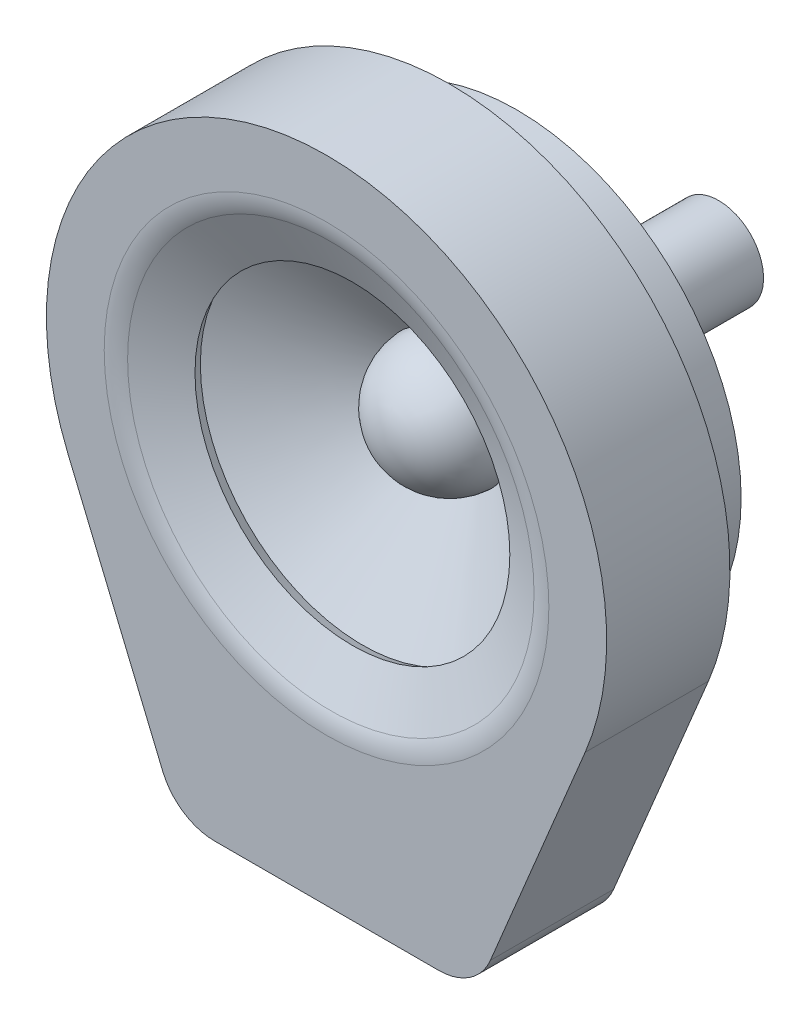
ISO-10303-21;
HEADER;
FILE_DESCRIPTION(('STEP AP214'),'2;1');
FILE_NAME('part.step','',(''),(''),'','','');
FILE_SCHEMA(('AUTOMOTIVE_DESIGN { 1 0 10303 214 1 1 1 1 }'));
ENDSEC;
DATA;
#1=APPLICATION_CONTEXT('core data for automotive mechanical design processes');
#2=APPLICATION_PROTOCOL_DEFINITION('international standard','automotive_design',2000,#1);
#3=PRODUCT_CONTEXT('',#1,'mechanical');
#4=PRODUCT('Part','Part','',(#3));
#5=PRODUCT_RELATED_PRODUCT_CATEGORY('part','',(#4));
#6=PRODUCT_DEFINITION_FORMATION('','',#4);
#7=PRODUCT_DEFINITION_CONTEXT('part definition',#1,'design');
#8=PRODUCT_DEFINITION('design','',#6,#7);
#9=PRODUCT_DEFINITION_SHAPE('','',#8);
#10=(LENGTH_UNIT() NAMED_UNIT(*) SI_UNIT(.MILLI.,.METRE.));
#11=(NAMED_UNIT(*) PLANE_ANGLE_UNIT() SI_UNIT($,.RADIAN.));
#12=(NAMED_UNIT(*) SI_UNIT($,.STERADIAN.) SOLID_ANGLE_UNIT());
#13=UNCERTAINTY_MEASURE_WITH_UNIT(LENGTH_MEASURE(1.E-05),#10,'distance_accuracy_value','');
#14=(GEOMETRIC_REPRESENTATION_CONTEXT(3) GLOBAL_UNCERTAINTY_ASSIGNED_CONTEXT((#13)) GLOBAL_UNIT_ASSIGNED_CONTEXT((#10,
#11,#12)) REPRESENTATION_CONTEXT('',''));
#15=CARTESIAN_POINT('',(0.,0.,0.));
#16=DIRECTION('',(0.,0.,1.));
#17=DIRECTION('',(1.,0.,0.));
#18=AXIS2_PLACEMENT_3D('',#15,#16,#17);
#19=CARTESIAN_POINT('',(0.,0.,0.));
#20=DIRECTION('',(0.,0.,1.));
#21=DIRECTION('',(1.,0.,0.));
#22=AXIS2_PLACEMENT_3D('',#19,#20,#21);
#23=PLANE('',#22);
#24=CARTESIAN_POINT('',(0.,0.,0.));
#25=DIRECTION('',(0.,0.,1.));
#26=DIRECTION('',(1.,0.,0.));
#27=AXIS2_PLACEMENT_3D('',#24,#25,#26);
#28=CIRCLE('',#27,12.5);
#29=CARTESIAN_POINT('',(11.5392129441462,-4.80588853695639,0.));
#30=VERTEX_POINT('',#29);
#31=CARTESIAN_POINT('',(-11.5392129441462,-4.80588853695639,0.));
#32=VERTEX_POINT('',#31);
#33=EDGE_CURVE('E144',#30,#32,#28,.T.);
#34=ORIENTED_EDGE('',*,*,#33,.F.);
#35=DIRECTION('',(0.384471082956511,0.923137035531696,0.));
#36=VECTOR('',#35,1.);
#37=CARTESIAN_POINT('',(7.30970543354696,-14.9611777073913,0.));
#38=LINE('',#37,#36);
#39=CARTESIAN_POINT('',(7.30970543354696,-14.9611777073913,0.));
#40=VERTEX_POINT('',#39);
#41=EDGE_CURVE('E68',#40,#30,#38,.T.);
#42=ORIENTED_EDGE('',*,*,#41,.F.);
#43=CARTESIAN_POINT('',(5.00186284471772,-14.,0.));
#44=DIRECTION('',(0.,0.,1.));
#45=DIRECTION('',(1.,0.,0.));
#46=AXIS2_PLACEMENT_3D('',#43,#44,#45);
#47=CIRCLE('',#46,2.5);
#48=CARTESIAN_POINT('',(5.00186284471772,-16.5,0.));
#49=VERTEX_POINT('',#48);
#50=EDGE_CURVE('E229',#49,#40,#47,.T.);
#51=ORIENTED_EDGE('',*,*,#50,.F.);
#52=DIRECTION('',(1.,0.,0.));
#53=VECTOR('',#52,1.);
#54=CARTESIAN_POINT('',(-5.00186284471772,-16.5,0.));
#55=LINE('',#54,#53);
#56=CARTESIAN_POINT('',(-5.00186284471771,-16.5,0.));
#57=VERTEX_POINT('',#56);
#58=EDGE_CURVE('E227',#57,#49,#55,.T.);
#59=ORIENTED_EDGE('',*,*,#58,.F.);
#60=CARTESIAN_POINT('',(-5.00186284471772,-14.,0.));
#61=DIRECTION('',(0.,0.,1.));
#62=DIRECTION('',(1.,0.,0.));
#63=AXIS2_PLACEMENT_3D('',#60,#61,#62);
#64=CIRCLE('',#63,2.5);
#65=CARTESIAN_POINT('',(-7.30970543354696,-14.9611777073913,0.));
#66=VERTEX_POINT('',#65);
#67=EDGE_CURVE('E225',#66,#57,#64,.T.);
#68=ORIENTED_EDGE('',*,*,#67,.F.);
#69=DIRECTION('',(0.384471082956511,-0.923137035531696,0.));
#70=VECTOR('',#69,1.);
#71=CARTESIAN_POINT('',(-7.30970543354696,-14.9611777073913,0.));
#72=LINE('',#71,#70);
#73=EDGE_CURVE('E223',#32,#66,#72,.T.);
#74=ORIENTED_EDGE('',*,*,#73,.F.);
#75=EDGE_LOOP('',(#34,#42,#51,#59,#68,#74));
#76=FACE_BOUND('',#75,.T.);
#77=CARTESIAN_POINT('',(0.,0.,0.));
#78=DIRECTION('',(0.,0.,1.));
#79=DIRECTION('',(1.,0.,0.));
#80=AXIS2_PLACEMENT_3D('',#77,#78,#79);
#81=CIRCLE('',#80,12.);
#82=CARTESIAN_POINT('',(11.0776444263804,-4.61365299547813,0.));
#83=VERTEX_POINT('',#82);
#84=CARTESIAN_POINT('',(-11.0776444263804,-4.61365299547814,0.));
#85=VERTEX_POINT('',#84);
#86=EDGE_CURVE('E60',#83,#85,#81,.T.);
#87=ORIENTED_EDGE('',*,*,#86,.T.);
#88=DIRECTION('',(0.384471082956511,-0.923137035531696,0.));
#89=VECTOR('',#88,1.);
#90=CARTESIAN_POINT('',(-6.84813691578111,-14.768942165913,0.));
#91=LINE('',#90,#89);
#92=CARTESIAN_POINT('',(-6.84813691578111,-14.768942165913,0.));
#93=VERTEX_POINT('',#92);
#94=EDGE_CURVE('E197',#85,#93,#91,.T.);
#95=ORIENTED_EDGE('',*,*,#94,.T.);
#96=CARTESIAN_POINT('',(-5.00186284471772,-14.,0.));
#97=DIRECTION('',(0.,0.,1.));
#98=DIRECTION('',(1.,0.,0.));
#99=AXIS2_PLACEMENT_3D('',#96,#97,#98);
#100=CIRCLE('',#99,2.);
#101=CARTESIAN_POINT('',(-5.00186284471772,-16.,0.));
#102=VERTEX_POINT('',#101);
#103=EDGE_CURVE('E200',#93,#102,#100,.T.);
#104=ORIENTED_EDGE('',*,*,#103,.T.);
#105=DIRECTION('',(1.,0.,0.));
#106=VECTOR('',#105,1.);
#107=CARTESIAN_POINT('',(-5.00186284471772,-16.,0.));
#108=LINE('',#107,#106);
#109=CARTESIAN_POINT('',(5.00186284471772,-16.,0.));
#110=VERTEX_POINT('',#109);
#111=EDGE_CURVE('E203',#102,#110,#108,.T.);
#112=ORIENTED_EDGE('',*,*,#111,.T.);
#113=CARTESIAN_POINT('',(5.00186284471772,-14.,0.));
#114=DIRECTION('',(0.,0.,1.));
#115=DIRECTION('',(1.,0.,0.));
#116=AXIS2_PLACEMENT_3D('',#113,#114,#115);
#117=CIRCLE('',#116,2.);
#118=CARTESIAN_POINT('',(6.84813691578111,-14.768942165913,0.));
#119=VERTEX_POINT('',#118);
#120=EDGE_CURVE('E206',#110,#119,#117,.T.);
#121=ORIENTED_EDGE('',*,*,#120,.T.);
#122=DIRECTION('',(0.384471082956511,0.923137035531696,0.));
#123=VECTOR('',#122,1.);
#124=CARTESIAN_POINT('',(6.84813691578111,-14.768942165913,0.));
#125=LINE('',#124,#123);
#126=EDGE_CURVE('E180',#119,#83,#125,.T.);
#127=ORIENTED_EDGE('',*,*,#126,.T.);
#128=EDGE_LOOP('',(#87,#95,#104,#112,#121,#127));
#129=FACE_BOUND('',#128,.T.);
#130=ADVANCED_FACE('F45',(#76,#129),#23,.F.);
#131=CARTESIAN_POINT('',(0.,0.,5.));
#132=DIRECTION('',(0.,0.,-1.));
#133=DIRECTION('',(-1.,0.,0.));
#134=AXIS2_PLACEMENT_3D('',#131,#132,#133);
#135=CYLINDRICAL_SURFACE('',#134,12.5);
#136=ORIENTED_EDGE('',*,*,#33,.T.);
#137=DIRECTION('',(0.,0.,-1.));
#138=VECTOR('',#137,1.);
#139=CARTESIAN_POINT('',(-11.5392129441462,-4.80588853695639,5.));
#140=LINE('',#139,#138);
#141=CARTESIAN_POINT('',(-11.5392129441462,-4.80588853695639,5.5));
#142=VERTEX_POINT('',#141);
#143=EDGE_CURVE('E138',#142,#32,#140,.T.);
#144=ORIENTED_EDGE('',*,*,#143,.F.);
#145=CARTESIAN_POINT('',(0.,0.,5.5));
#146=DIRECTION('',(0.,0.,1.));
#147=DIRECTION('',(1.,0.,0.));
#148=AXIS2_PLACEMENT_3D('',#145,#146,#147);
#149=CIRCLE('',#148,12.5);
#150=CARTESIAN_POINT('',(11.5392129441462,-4.80588853695639,5.5));
#151=VERTEX_POINT('',#150);
#152=EDGE_CURVE('E142',#151,#142,#149,.T.);
#153=ORIENTED_EDGE('',*,*,#152,.F.);
#154=DIRECTION('',(0.,0.,-1.));
#155=VECTOR('',#154,1.);
#156=CARTESIAN_POINT('',(11.5392129441462,-4.80588853695639,5.));
#157=LINE('',#156,#155);
#158=EDGE_CURVE('E232',#151,#30,#157,.T.);
#159=ORIENTED_EDGE('',*,*,#158,.T.);
#160=EDGE_LOOP('',(#136,#144,#153,#159));
#161=FACE_BOUND('',#160,.T.);
#162=ADVANCED_FACE('F140',(#161),#135,.T.);
#163=CARTESIAN_POINT('',(-7.30970543354696,-14.9611777073913,5.));
#164=DIRECTION('',(0.923137035531696,0.384471082956511,0.));
#165=DIRECTION('',(-0.384471082956511,0.923137035531696,0.));
#166=AXIS2_PLACEMENT_3D('',#163,#164,#165);
#167=PLANE('',#166);
#168=ORIENTED_EDGE('',*,*,#73,.T.);
#169=DIRECTION('',(0.,0.,-1.));
#170=VECTOR('',#169,1.);
#171=CARTESIAN_POINT('',(-7.30970543354696,-14.9611777073913,5.));
#172=LINE('',#171,#170);
#173=CARTESIAN_POINT('',(-7.30970543354696,-14.9611777073913,5.5));
#174=VERTEX_POINT('',#173);
#175=EDGE_CURVE('E146',#174,#66,#172,.T.);
#176=ORIENTED_EDGE('',*,*,#175,.F.);
#177=DIRECTION('',(0.384471082956511,-0.923137035531696,0.));
#178=VECTOR('',#177,1.);
#179=CARTESIAN_POINT('',(-11.5392129441462,-4.80588853695639,5.5));
#180=LINE('',#179,#178);
#181=EDGE_CURVE('E149',#142,#174,#180,.T.);
#182=ORIENTED_EDGE('',*,*,#181,.F.);
#183=ORIENTED_EDGE('',*,*,#143,.T.);
#184=EDGE_LOOP('',(#168,#176,#182,#183));
#185=FACE_BOUND('',#184,.T.);
#186=ADVANCED_FACE('F150',(#185),#167,.F.);
#187=CARTESIAN_POINT('',(-5.00186284471772,-14.,5.));
#188=DIRECTION('',(0.,0.,-1.));
#189=DIRECTION('',(-1.,0.,0.));
#190=AXIS2_PLACEMENT_3D('',#187,#188,#189);
#191=CYLINDRICAL_SURFACE('',#190,2.5);
#192=ORIENTED_EDGE('',*,*,#67,.T.);
#193=DIRECTION('',(0.,0.,-1.));
#194=VECTOR('',#193,1.);
#195=CARTESIAN_POINT('',(-5.00186284471771,-16.5,5.));
#196=LINE('',#195,#194);
#197=CARTESIAN_POINT('',(-5.00186284471772,-16.5,5.5));
#198=VERTEX_POINT('',#197);
#199=EDGE_CURVE('E239',#198,#57,#196,.T.);
#200=ORIENTED_EDGE('',*,*,#199,.F.);
#201=CARTESIAN_POINT('',(-5.00186284471772,-14.,5.5));
#202=DIRECTION('',(0.,0.,1.));
#203=DIRECTION('',(1.,0.,0.));
#204=AXIS2_PLACEMENT_3D('',#201,#202,#203);
#205=CIRCLE('',#204,2.5);
#206=EDGE_CURVE('E155',#174,#198,#205,.T.);
#207=ORIENTED_EDGE('',*,*,#206,.F.);
#208=ORIENTED_EDGE('',*,*,#175,.T.);
#209=EDGE_LOOP('',(#192,#200,#207,#208));
#210=FACE_BOUND('',#209,.T.);
#211=ADVANCED_FACE('F277',(#210),#191,.T.);
#212=CARTESIAN_POINT('',(-5.00186284471772,-16.5,5.));
#213=DIRECTION('',(0.,1.,0.));
#214=DIRECTION('',(0.,0.,1.));
#215=AXIS2_PLACEMENT_3D('',#212,#213,#214);
#216=PLANE('',#215);
#217=ORIENTED_EDGE('',*,*,#58,.T.);
#218=DIRECTION('',(0.,0.,-1.));
#219=VECTOR('',#218,1.);
#220=CARTESIAN_POINT('',(5.00186284471772,-16.5,5.));
#221=LINE('',#220,#219);
#222=CARTESIAN_POINT('',(5.00186284471772,-16.5,5.5));
#223=VERTEX_POINT('',#222);
#224=EDGE_CURVE('E236',#223,#49,#221,.T.);
#225=ORIENTED_EDGE('',*,*,#224,.F.);
#226=DIRECTION('',(1.,0.,0.));
#227=VECTOR('',#226,1.);
#228=CARTESIAN_POINT('',(-5.00186284471772,-16.5,5.5));
#229=LINE('',#228,#227);
#230=EDGE_CURVE('E170',#198,#223,#229,.T.);
#231=ORIENTED_EDGE('',*,*,#230,.F.);
#232=ORIENTED_EDGE('',*,*,#199,.T.);
#233=EDGE_LOOP('',(#217,#225,#231,#232));
#234=FACE_BOUND('',#233,.T.);
#235=ADVANCED_FACE('F273',(#234),#216,.F.);
#236=CARTESIAN_POINT('',(5.00186284471772,-14.,5.));
#237=DIRECTION('',(0.,0.,-1.));
#238=DIRECTION('',(-1.,0.,0.));
#239=AXIS2_PLACEMENT_3D('',#236,#237,#238);
#240=CYLINDRICAL_SURFACE('',#239,2.5);
#241=ORIENTED_EDGE('',*,*,#50,.T.);
#242=DIRECTION('',(0.,0.,-1.));
#243=VECTOR('',#242,1.);
#244=CARTESIAN_POINT('',(7.30970543354696,-14.9611777073913,5.));
#245=LINE('',#244,#243);
#246=CARTESIAN_POINT('',(7.30970543354696,-14.9611777073913,5.5));
#247=VERTEX_POINT('',#246);
#248=EDGE_CURVE('E234',#247,#40,#245,.T.);
#249=ORIENTED_EDGE('',*,*,#248,.F.);
#250=CARTESIAN_POINT('',(5.00186284471772,-14.,5.5));
#251=DIRECTION('',(0.,0.,1.));
#252=DIRECTION('',(1.,0.,0.));
#253=AXIS2_PLACEMENT_3D('',#250,#251,#252);
#254=CIRCLE('',#253,2.5);
#255=EDGE_CURVE('E173',#223,#247,#254,.T.);
#256=ORIENTED_EDGE('',*,*,#255,.F.);
#257=ORIENTED_EDGE('',*,*,#224,.T.);
#258=EDGE_LOOP('',(#241,#249,#256,#257));
#259=FACE_BOUND('',#258,.T.);
#260=ADVANCED_FACE('F270',(#259),#240,.T.);
#261=CARTESIAN_POINT('',(7.30970543354696,-14.9611777073913,5.));
#262=DIRECTION('',(-0.923137035531696,0.384471082956511,0.));
#263=DIRECTION('',(-0.384471082956511,-0.923137035531696,0.));
#264=AXIS2_PLACEMENT_3D('',#261,#262,#263);
#265=PLANE('',#264);
#266=ORIENTED_EDGE('',*,*,#41,.T.);
#267=ORIENTED_EDGE('',*,*,#158,.F.);
#268=DIRECTION('',(0.384471082956511,0.923137035531696,0.));
#269=VECTOR('',#268,1.);
#270=CARTESIAN_POINT('',(7.30970543354696,-14.9611777073913,5.5));
#271=LINE('',#270,#269);
#272=EDGE_CURVE('E161',#247,#151,#271,.T.);
#273=ORIENTED_EDGE('',*,*,#272,.F.);
#274=ORIENTED_EDGE('',*,*,#248,.T.);
#275=EDGE_LOOP('',(#266,#267,#273,#274));
#276=FACE_BOUND('',#275,.T.);
#277=ADVANCED_FACE('F267',(#276),#265,.F.);
#278=CARTESIAN_POINT('',(0.,0.,5.));
#279=DIRECTION('',(0.,0.,-1.));
#280=DIRECTION('',(-1.,0.,0.));
#281=AXIS2_PLACEMENT_3D('',#278,#279,#280);
#282=CYLINDRICAL_SURFACE('',#281,12.);
#283=ORIENTED_EDGE('',*,*,#86,.F.);
#284=DIRECTION('',(0.,0.,-1.));
#285=VECTOR('',#284,1.);
#286=CARTESIAN_POINT('',(11.0776444263804,-4.61365299547813,5.));
#287=LINE('',#286,#285);
#288=CARTESIAN_POINT('',(11.0776444263804,-4.61365299547813,5.));
#289=VERTEX_POINT('',#288);
#290=EDGE_CURVE('E195',#289,#83,#287,.T.);
#291=ORIENTED_EDGE('',*,*,#290,.F.);
#292=CARTESIAN_POINT('',(0.,0.,5.));
#293=DIRECTION('',(0.,0.,1.));
#294=DIRECTION('',(1.,0.,0.));
#295=AXIS2_PLACEMENT_3D('',#292,#293,#294);
#296=CIRCLE('',#295,12.);
#297=CARTESIAN_POINT('',(-11.0776444263804,-4.61365299547813,5.));
#298=VERTEX_POINT('',#297);
#299=EDGE_CURVE('E176',#289,#298,#296,.T.);
#300=ORIENTED_EDGE('',*,*,#299,.T.);
#301=DIRECTION('',(0.,0.,-1.));
#302=VECTOR('',#301,1.);
#303=CARTESIAN_POINT('',(-11.0776444263804,-4.61365299547814,5.));
#304=LINE('',#303,#302);
#305=EDGE_CURVE('E220',#298,#85,#304,.T.);
#306=ORIENTED_EDGE('',*,*,#305,.T.);
#307=EDGE_LOOP('',(#283,#291,#300,#306));
#308=FACE_BOUND('',#307,.T.);
#309=ADVANCED_FACE('F265',(#308),#282,.F.);
#310=CARTESIAN_POINT('',(-6.84813691578111,-14.768942165913,5.));
#311=DIRECTION('',(0.923137035531696,0.384471082956511,0.));
#312=DIRECTION('',(-0.384471082956511,0.923137035531696,0.));
#313=AXIS2_PLACEMENT_3D('',#310,#311,#312);
#314=PLANE('',#313);
#315=ORIENTED_EDGE('',*,*,#94,.F.);
#316=ORIENTED_EDGE('',*,*,#305,.F.);
#317=DIRECTION('',(0.384471082956511,-0.923137035531696,0.));
#318=VECTOR('',#317,1.);
#319=CARTESIAN_POINT('',(-6.84813691578111,-14.768942165913,5.));
#320=LINE('',#319,#318);
#321=CARTESIAN_POINT('',(-6.84813691578111,-14.768942165913,5.));
#322=VERTEX_POINT('',#321);
#323=EDGE_CURVE('E179',#298,#322,#320,.T.);
#324=ORIENTED_EDGE('',*,*,#323,.T.);
#325=DIRECTION('',(0.,0.,-1.));
#326=VECTOR('',#325,1.);
#327=CARTESIAN_POINT('',(-6.84813691578111,-14.768942165913,5.));
#328=LINE('',#327,#326);
#329=EDGE_CURVE('E218',#322,#93,#328,.T.);
#330=ORIENTED_EDGE('',*,*,#329,.T.);
#331=EDGE_LOOP('',(#315,#316,#324,#330));
#332=FACE_BOUND('',#331,.T.);
#333=ADVANCED_FACE('F309',(#332),#314,.T.);
#334=CARTESIAN_POINT('',(-5.00186284471772,-14.,5.));
#335=DIRECTION('',(0.,0.,-1.));
#336=DIRECTION('',(-1.,0.,0.));
#337=AXIS2_PLACEMENT_3D('',#334,#335,#336);
#338=CYLINDRICAL_SURFACE('',#337,2.);
#339=ORIENTED_EDGE('',*,*,#103,.F.);
#340=ORIENTED_EDGE('',*,*,#329,.F.);
#341=CARTESIAN_POINT('',(-5.00186284471772,-14.,5.));
#342=DIRECTION('',(0.,0.,1.));
#343=DIRECTION('',(1.,0.,0.));
#344=AXIS2_PLACEMENT_3D('',#341,#342,#343);
#345=CIRCLE('',#344,2.);
#346=CARTESIAN_POINT('',(-5.00186284471772,-16.,5.));
#347=VERTEX_POINT('',#346);
#348=EDGE_CURVE('E183',#322,#347,#345,.T.);
#349=ORIENTED_EDGE('',*,*,#348,.T.);
#350=DIRECTION('',(0.,0.,-1.));
#351=VECTOR('',#350,1.);
#352=CARTESIAN_POINT('',(-5.00186284471772,-16.,5.));
#353=LINE('',#352,#351);
#354=EDGE_CURVE('E216',#347,#102,#353,.T.);
#355=ORIENTED_EDGE('',*,*,#354,.T.);
#356=EDGE_LOOP('',(#339,#340,#349,#355));
#357=FACE_BOUND('',#356,.T.);
#358=ADVANCED_FACE('F315',(#357),#338,.F.);
#359=CARTESIAN_POINT('',(-5.00186284471772,-16.,5.));
#360=DIRECTION('',(0.,1.,0.));
#361=DIRECTION('',(0.,0.,1.));
#362=AXIS2_PLACEMENT_3D('',#359,#360,#361);
#363=PLANE('',#362);
#364=ORIENTED_EDGE('',*,*,#111,.F.);
#365=ORIENTED_EDGE('',*,*,#354,.F.);
#366=DIRECTION('',(1.,0.,0.));
#367=VECTOR('',#366,1.);
#368=CARTESIAN_POINT('',(-5.00186284471772,-16.,5.));
#369=LINE('',#368,#367);
#370=CARTESIAN_POINT('',(5.00186284471772,-16.,5.));
#371=VERTEX_POINT('',#370);
#372=EDGE_CURVE('E186',#347,#371,#369,.T.);
#373=ORIENTED_EDGE('',*,*,#372,.T.);
#374=DIRECTION('',(0.,0.,-1.));
#375=VECTOR('',#374,1.);
#376=CARTESIAN_POINT('',(5.00186284471772,-16.,5.));
#377=LINE('',#376,#375);
#378=EDGE_CURVE('E214',#371,#110,#377,.T.);
#379=ORIENTED_EDGE('',*,*,#378,.T.);
#380=EDGE_LOOP('',(#364,#365,#373,#379));
#381=FACE_BOUND('',#380,.T.);
#382=ADVANCED_FACE('F322',(#381),#363,.T.);
#383=CARTESIAN_POINT('',(5.00186284471772,-14.,5.));
#384=DIRECTION('',(0.,0.,-1.));
#385=DIRECTION('',(-1.,0.,0.));
#386=AXIS2_PLACEMENT_3D('',#383,#384,#385);
#387=CYLINDRICAL_SURFACE('',#386,2.);
#388=ORIENTED_EDGE('',*,*,#120,.F.);
#389=ORIENTED_EDGE('',*,*,#378,.F.);
#390=CARTESIAN_POINT('',(5.00186284471772,-14.,5.));
#391=DIRECTION('',(0.,0.,1.));
#392=DIRECTION('',(1.,0.,0.));
#393=AXIS2_PLACEMENT_3D('',#390,#391,#392);
#394=CIRCLE('',#393,2.);
#395=CARTESIAN_POINT('',(6.84813691578111,-14.768942165913,5.));
#396=VERTEX_POINT('',#395);
#397=EDGE_CURVE('E189',#371,#396,#394,.T.);
#398=ORIENTED_EDGE('',*,*,#397,.T.);
#399=DIRECTION('',(0.,0.,-1.));
#400=VECTOR('',#399,1.);
#401=CARTESIAN_POINT('',(6.84813691578111,-14.768942165913,5.));
#402=LINE('',#401,#400);
#403=EDGE_CURVE('E212',#396,#119,#402,.T.);
#404=ORIENTED_EDGE('',*,*,#403,.T.);
#405=EDGE_LOOP('',(#388,#389,#398,#404));
#406=FACE_BOUND('',#405,.T.);
#407=ADVANCED_FACE('F330',(#406),#387,.F.);
#408=CARTESIAN_POINT('',(6.84813691578111,-14.768942165913,5.));
#409=DIRECTION('',(-0.923137035531696,0.384471082956511,0.));
#410=DIRECTION('',(-0.384471082956511,-0.923137035531696,0.));
#411=AXIS2_PLACEMENT_3D('',#408,#409,#410);
#412=PLANE('',#411);
#413=ORIENTED_EDGE('',*,*,#126,.F.);
#414=ORIENTED_EDGE('',*,*,#403,.F.);
#415=DIRECTION('',(0.384471082956511,0.923137035531696,0.));
#416=VECTOR('',#415,1.);
#417=CARTESIAN_POINT('',(6.84813691578111,-14.768942165913,5.));
#418=LINE('',#417,#416);
#419=EDGE_CURVE('E192',#396,#289,#418,.T.);
#420=ORIENTED_EDGE('',*,*,#419,.T.);
#421=ORIENTED_EDGE('',*,*,#290,.T.);
#422=EDGE_LOOP('',(#413,#414,#420,#421));
#423=FACE_BOUND('',#422,.T.);
#424=ADVANCED_FACE('F338',(#423),#412,.T.);
#425=CARTESIAN_POINT('',(0.,0.,5.5));
#426=DIRECTION('',(0.,0.,1.));
#427=DIRECTION('',(1.,0.,0.));
#428=AXIS2_PLACEMENT_3D('',#425,#426,#427);
#429=PLANE('',#428);
#430=CARTESIAN_POINT('',(0.,0.,5.5));
#431=DIRECTION('',(0.,0.,1.));
#432=DIRECTION('',(1.,0.,0.));
#433=AXIS2_PLACEMENT_3D('',#430,#431,#432);
#434=CIRCLE('',#433,9.92109103035221);
#435=CARTESIAN_POINT('',(9.92109103035221,0.,5.5));
#436=VERTEX_POINT('',#435);
#437=EDGE_CURVE('E53',#436,#436,#434,.F.);
#438=ORIENTED_EDGE('',*,*,#437,.T.);
#439=EDGE_LOOP('',(#438));
#440=FACE_BOUND('',#439,.T.);
#441=ORIENTED_EDGE('',*,*,#152,.T.);
#442=ORIENTED_EDGE('',*,*,#181,.T.);
#443=ORIENTED_EDGE('',*,*,#206,.T.);
#444=ORIENTED_EDGE('',*,*,#230,.T.);
#445=ORIENTED_EDGE('',*,*,#255,.T.);
#446=ORIENTED_EDGE('',*,*,#272,.T.);
#447=EDGE_LOOP('',(#441,#442,#443,#444,#445,#446));
#448=FACE_BOUND('',#447,.T.);
#449=ADVANCED_FACE('F158',(#440,#448),#429,.T.);
#450=CARTESIAN_POINT('',(0.,0.,5.));
#451=DIRECTION('',(0.,0.,1.));
#452=DIRECTION('',(1.,0.,0.));
#453=AXIS2_PLACEMENT_3D('',#450,#451,#452);
#454=PLANE('',#453);
#455=ORIENTED_EDGE('',*,*,#299,.F.);
#456=ORIENTED_EDGE('',*,*,#419,.F.);
#457=ORIENTED_EDGE('',*,*,#397,.F.);
#458=ORIENTED_EDGE('',*,*,#372,.F.);
#459=ORIENTED_EDGE('',*,*,#348,.F.);
#460=ORIENTED_EDGE('',*,*,#323,.F.);
#461=EDGE_LOOP('',(#455,#456,#457,#458,#459,#460));
#462=FACE_BOUND('',#461,.T.);
#463=CARTESIAN_POINT('',(0.,0.,5.));
#464=DIRECTION('',(0.,0.,-1.));
#465=DIRECTION('',(-1.,0.,0.));
#466=AXIS2_PLACEMENT_3D('',#463,#464,#465);
#467=CIRCLE('',#466,9.58517656815572);
#468=CARTESIAN_POINT('',(-9.58517656815572,0.,5.));
#469=VERTEX_POINT('',#468);
#470=EDGE_CURVE('E162',#469,#469,#467,.T.);
#471=ORIENTED_EDGE('',*,*,#470,.F.);
#472=EDGE_LOOP('',(#471));
#473=FACE_BOUND('',#472,.T.);
#474=ADVANCED_FACE('F354',(#462,#473),#454,.F.);
#475=CARTESIAN_POINT('',(0.,0.,5.5));
#476=DIRECTION('',(0.,0.,1.));
#477=DIRECTION('',(1.,0.,0.));
#478=AXIS2_PLACEMENT_3D('',#475,#476,#477);
#479=CONICAL_SURFACE('',#478,9.47320508075689,1.13018008063184);
#480=CARTESIAN_POINT('',(0.,0.,5.30897801576319));
#481=DIRECTION('',(0.,0.,-1.));
#482=DIRECTION('',(-1.,0.,0.));
#483=AXIS2_PLACEMENT_3D('',#480,#481,#482);
#484=CIRCLE('',#483,9.06809716256332);
#485=CARTESIAN_POINT('',(-9.06809716256332,0.,5.30897801576319));
#486=VERTEX_POINT('',#485);
#487=EDGE_CURVE('E12',#486,#486,#484,.F.);
#488=ORIENTED_EDGE('',*,*,#487,.T.);
#489=EDGE_LOOP('',(#488));
#490=FACE_BOUND('',#489,.T.);
#491=CARTESIAN_POINT('',(0.,0.,4.34544749938727));
#492=DIRECTION('',(0.,0.,-1.));
#493=DIRECTION('',(-1.,0.,0.));
#494=AXIS2_PLACEMENT_3D('',#491,#492,#493);
#495=CIRCLE('',#494,7.02469968051675);
#496=CARTESIAN_POINT('',(-7.02469968051675,0.,4.34544749938727));
#497=VERTEX_POINT('',#496);
#498=EDGE_CURVE('E500',#497,#497,#495,.T.);
#499=ORIENTED_EDGE('',*,*,#498,.T.);
#500=EDGE_LOOP('',(#499));
#501=FACE_BOUND('',#500,.T.);
#502=ADVANCED_FACE('F362',(#490,#501),#479,.F.);
#503=CARTESIAN_POINT('',(0.,0.,5.));
#504=DIRECTION('',(0.,0.,1.));
#505=DIRECTION('',(1.,0.,0.));
#506=AXIS2_PLACEMENT_3D('',#503,#504,#505);
#507=CONICAL_SURFACE('',#506,9.58517656815572,1.13018008063184);
#508=CARTESIAN_POINT('',(0.,0.,3.89320299544648));
#509=DIRECTION('',(0.,0.,-1.));
#510=DIRECTION('',(-1.,0.,0.));
#511=AXIS2_PLACEMENT_3D('',#508,#509,#510);
#512=CIRCLE('',#511,7.23794814746397);
#513=CARTESIAN_POINT('',(-7.23794814746397,0.,3.89320299544648));
#514=VERTEX_POINT('',#513);
#515=EDGE_CURVE('E165',#514,#514,#512,.T.);
#516=ORIENTED_EDGE('',*,*,#515,.F.);
#517=EDGE_LOOP('',(#516));
#518=FACE_BOUND('',#517,.T.);
#519=ORIENTED_EDGE('',*,*,#470,.T.);
#520=EDGE_LOOP('',(#519));
#521=FACE_BOUND('',#520,.T.);
#522=ADVANCED_FACE('F252',(#518,#521),#507,.T.);
#523=CARTESIAN_POINT('',(0.,0.,3.89320299544648));
#524=DIRECTION('',(0.,0.,-1.));
#525=DIRECTION('',(-1.,0.,0.));
#526=AXIS2_PLACEMENT_3D('',#523,#524,#525);
#527=CONICAL_SURFACE('',#526,7.23794814746397,0.440616246163057);
#528=ORIENTED_EDGE('',*,*,#498,.F.);
#529=EDGE_LOOP('',(#528));
#530=FACE_BOUND('',#529,.T.);
#531=ORIENTED_EDGE('',*,*,#515,.T.);
#532=EDGE_LOOP('',(#531));
#533=FACE_BOUND('',#532,.T.);
#534=ADVANCED_FACE('F247',(#530,#533),#527,.F.);
#535=CARTESIAN_POINT('',(0.,0.,3.5));
#536=DIRECTION('',(0.,0.,1.));
#537=DIRECTION('',(1.,0.,0.));
#538=AXIS2_PLACEMENT_3D('',#535,#536,#537);
#539=TOROIDAL_SURFACE('',#538,9.92109103035221,2.);
#540=ORIENTED_EDGE('',*,*,#487,.F.);
#541=EDGE_LOOP('',(#540));
#542=FACE_BOUND('',#541,.T.);
#543=ORIENTED_EDGE('',*,*,#437,.F.);
#544=EDGE_LOOP('',(#543));
#545=FACE_BOUND('',#544,.T.);
#546=ADVANCED_FACE('F47',(#542,#545),#539,.T.);
#547=CLOSED_SHELL('',(#130,#162,#186,#211,#235,#260,#277,#309,#333,#358,#382,#407,#424,#449,
#474,#502,#522,#534,#546));
#548=MANIFOLD_SOLID_BREP('B2',#547);
#549=CARTESIAN_POINT('',(0.,9.,3.59171250028112));
#550=DIRECTION('',(0.,0.,-1.));
#551=DIRECTION('',(-1.,0.,0.));
#552=AXIS2_PLACEMENT_3D('',#549,#550,#551);
#553=PLANE('',#552);
#554=CARTESIAN_POINT('',(0.,0.,3.59171250028112));
#555=DIRECTION('',(0.,0.,-1.));
#556=DIRECTION('',(-1.,0.,0.));
#557=AXIS2_PLACEMENT_3D('',#554,#555,#556);
#558=CIRCLE('',#557,11.);
#559=CARTESIAN_POINT('',(-11.,0.,3.59171250028112));
#560=VERTEX_POINT('',#559);
#561=EDGE_CURVE('E44',#560,#560,#558,.T.);
#562=ORIENTED_EDGE('',*,*,#561,.T.);
#563=EDGE_LOOP('',(#562));
#564=FACE_BOUND('',#563,.T.);
#565=CARTESIAN_POINT('',(0.,0.,3.59171250028112));
#566=DIRECTION('',(0.,0.,-1.));
#567=DIRECTION('',(-1.,0.,0.));
#568=AXIS2_PLACEMENT_3D('',#565,#566,#567);
#569=CIRCLE('',#568,9.);
#570=CARTESIAN_POINT('',(-9.,0.,3.59171250028112));
#571=VERTEX_POINT('',#570);
#572=EDGE_CURVE('E550',#571,#571,#569,.T.);
#573=ORIENTED_EDGE('',*,*,#572,.F.);
#574=EDGE_LOOP('',(#573));
#575=FACE_BOUND('',#574,.T.);
#576=ADVANCED_FACE('F528',(#564,#575),#553,.T.);
#577=CARTESIAN_POINT('',(0.,0.,0.));
#578=DIRECTION('',(0.,0.,-1.));
#579=DIRECTION('',(-1.,0.,0.));
#580=AXIS2_PLACEMENT_3D('',#577,#578,#579);
#581=CYLINDRICAL_SURFACE('',#580,11.);
#582=ORIENTED_EDGE('',*,*,#561,.F.);
#583=EDGE_LOOP('',(#582));
#584=FACE_BOUND('',#583,.T.);
#585=CARTESIAN_POINT('',(0.,0.,3.69171250028112));
#586=DIRECTION('',(0.,0.,-1.));
#587=DIRECTION('',(-1.,0.,0.));
#588=AXIS2_PLACEMENT_3D('',#585,#586,#587);
#589=CIRCLE('',#588,11.);
#590=CARTESIAN_POINT('',(-11.,0.,3.69171250028112));
#591=VERTEX_POINT('',#590);
#592=EDGE_CURVE('E534',#591,#591,#589,.T.);
#593=ORIENTED_EDGE('',*,*,#592,.T.);
#594=EDGE_LOOP('',(#593));
#595=FACE_BOUND('',#594,.T.);
#596=ADVANCED_FACE('F558',(#584,#595),#581,.T.);
#597=CARTESIAN_POINT('',(0.,9.,3.69171250028112));
#598=DIRECTION('',(0.,0.,-1.));
#599=DIRECTION('',(-1.,0.,0.));
#600=AXIS2_PLACEMENT_3D('',#597,#598,#599);
#601=PLANE('',#600);
#602=ORIENTED_EDGE('',*,*,#592,.F.);
#603=EDGE_LOOP('',(#602));
#604=FACE_BOUND('',#603,.T.);
#605=CARTESIAN_POINT('',(0.,0.,3.69171250028112));
#606=DIRECTION('',(0.,0.,-1.));
#607=DIRECTION('',(-1.,0.,0.));
#608=AXIS2_PLACEMENT_3D('',#605,#606,#607);
#609=CIRCLE('',#608,8.97320508075689);
#610=CARTESIAN_POINT('',(-8.97320508075689,0.,3.69171250028112));
#611=VERTEX_POINT('',#610);
#612=EDGE_CURVE('E538',#611,#611,#609,.T.);
#613=ORIENTED_EDGE('',*,*,#612,.T.);
#614=EDGE_LOOP('',(#613));
#615=FACE_BOUND('',#614,.T.);
#616=ADVANCED_FACE('F562',(#604,#615),#601,.F.);
#617=CARTESIAN_POINT('',(0.,0.,0.170294668544282));
#618=DIRECTION('',(0.,0.,1.));
#619=DIRECTION('',(1.,0.,0.));
#620=AXIS2_PLACEMENT_3D('',#617,#618,#619);
#621=CONICAL_SURFACE('',#620,2.87393048150957,1.0471975511966);
#622=ORIENTED_EDGE('',*,*,#612,.F.);
#623=EDGE_LOOP('',(#622));
#624=FACE_BOUND('',#623,.T.);
#625=CARTESIAN_POINT('',(0.,0.,0.170294668544282));
#626=DIRECTION('',(0.,0.,-1.));
#627=DIRECTION('',(-1.,0.,0.));
#628=AXIS2_PLACEMENT_3D('',#625,#626,#627);
#629=CIRCLE('',#628,2.87393048150957);
#630=CARTESIAN_POINT('',(-2.87393048150957,0.,0.170294668544282));
#631=VERTEX_POINT('',#630);
#632=EDGE_CURVE('E542',#631,#631,#629,.T.);
#633=ORIENTED_EDGE('',*,*,#632,.T.);
#634=EDGE_LOOP('',(#633));
#635=FACE_BOUND('',#634,.T.);
#636=ADVANCED_FACE('F567',(#624,#635),#621,.F.);
#637=CARTESIAN_POINT('',(0.,0.,0.));
#638=DIRECTION('',(0.,0.,-1.));
#639=DIRECTION('',(0.,1.,0.));
#640=AXIS2_PLACEMENT_3D('',#637,#638,#639);
#641=SPHERICAL_SURFACE('',#640,2.87897146333278);
#642=ORIENTED_EDGE('',*,*,#632,.F.);
#643=EDGE_LOOP('',(#642));
#644=FACE_BOUND('',#643,.T.);
#645=ADVANCED_FACE('F573',(#644),#641,.T.);
#646=CARTESIAN_POINT('',(0.,0.,0.));
#647=DIRECTION('',(0.,0.,-1.));
#648=DIRECTION('',(0.,1.,0.));
#649=AXIS2_PLACEMENT_3D('',#646,#647,#648);
#650=SPHERICAL_SURFACE('',#649,2.77897146333278);
#651=CARTESIAN_POINT('',(0.,0.,0.));
#652=DIRECTION('',(0.,0.,-1.));
#653=DIRECTION('',(-1.,0.,0.));
#654=AXIS2_PLACEMENT_3D('',#651,#652,#653);
#655=CIRCLE('',#654,2.77897146333278);
#656=CARTESIAN_POINT('',(-2.77897146333278,0.,0.));
#657=VERTEX_POINT('',#656);
#658=EDGE_CURVE('E547',#657,#657,#655,.T.);
#659=ORIENTED_EDGE('',*,*,#658,.T.);
#660=EDGE_LOOP('',(#659));
#661=FACE_BOUND('',#660,.T.);
#662=ADVANCED_FACE('F577',(#661),#650,.F.);
#663=CARTESIAN_POINT('',(0.,0.,0.));
#664=DIRECTION('',(0.,0.,1.));
#665=DIRECTION('',(1.,0.,0.));
#666=AXIS2_PLACEMENT_3D('',#663,#664,#665);
#667=CONICAL_SURFACE('',#666,2.77897146333278,1.0471975511966);
#668=ORIENTED_EDGE('',*,*,#572,.T.);
#669=EDGE_LOOP('',(#668));
#670=FACE_BOUND('',#669,.T.);
#671=ORIENTED_EDGE('',*,*,#658,.F.);
#672=EDGE_LOOP('',(#671));
#673=FACE_BOUND('',#672,.T.);
#674=ADVANCED_FACE('F554',(#670,#673),#667,.T.);
#675=CLOSED_SHELL('',(#576,#596,#616,#636,#645,#662,#674));
#676=MANIFOLD_SOLID_BREP('B6',#675);
#677=CARTESIAN_POINT('',(0.,10.,0.));
#678=DIRECTION('',(0.,0.,1.));
#679=DIRECTION('',(1.,0.,0.));
#680=AXIS2_PLACEMENT_3D('',#677,#678,#679);
#681=PLANE('',#680);
#682=CARTESIAN_POINT('',(0.,0.,0.));
#683=DIRECTION('',(0.,0.,-1.));
#684=DIRECTION('',(-1.,0.,0.));
#685=AXIS2_PLACEMENT_3D('',#682,#683,#684);
#686=CIRCLE('',#685,10.);
#687=CARTESIAN_POINT('',(-10.,0.,0.));
#688=VERTEX_POINT('',#687);
#689=EDGE_CURVE('E527',#688,#688,#686,.T.);
#690=ORIENTED_EDGE('',*,*,#689,.F.);
#691=EDGE_LOOP('',(#690));
#692=FACE_BOUND('',#691,.T.);
#693=ADVANCED_FACE('F642',(#692),#681,.T.);
#694=CARTESIAN_POINT('',(0.,0.,0.));
#695=DIRECTION('',(0.,0.,-1.));
#696=DIRECTION('',(-1.,0.,0.));
#697=AXIS2_PLACEMENT_3D('',#694,#695,#696);
#698=CYLINDRICAL_SURFACE('',#697,10.);
#699=ORIENTED_EDGE('',*,*,#689,.T.);
#700=EDGE_LOOP('',(#699));
#701=FACE_BOUND('',#700,.T.);
#702=CARTESIAN_POINT('',(0.,0.,-3.));
#703=DIRECTION('',(0.,0.,-1.));
#704=DIRECTION('',(-1.,0.,0.));
#705=AXIS2_PLACEMENT_3D('',#702,#703,#704);
#706=CIRCLE('',#705,10.);
#707=CARTESIAN_POINT('',(-10.,0.,-3.));
#708=VERTEX_POINT('',#707);
#709=EDGE_CURVE('E648',#708,#708,#706,.T.);
#710=ORIENTED_EDGE('',*,*,#709,.F.);
#711=EDGE_LOOP('',(#710));
#712=FACE_BOUND('',#711,.T.);
#713=ADVANCED_FACE('F674',(#701,#712),#698,.T.);
#714=CARTESIAN_POINT('',(0.,2.,-3.));
#715=DIRECTION('',(0.,0.,-1.));
#716=DIRECTION('',(-1.,0.,0.));
#717=AXIS2_PLACEMENT_3D('',#714,#715,#716);
#718=PLANE('',#717);
#719=ORIENTED_EDGE('',*,*,#709,.T.);
#720=EDGE_LOOP('',(#719));
#721=FACE_BOUND('',#720,.T.);
#722=CARTESIAN_POINT('',(0.,0.,-3.));
#723=DIRECTION('',(0.,0.,-1.));
#724=DIRECTION('',(-1.,0.,0.));
#725=AXIS2_PLACEMENT_3D('',#722,#723,#724);
#726=CIRCLE('',#725,2.);
#727=CARTESIAN_POINT('',(-2.,0.,-3.));
#728=VERTEX_POINT('',#727);
#729=EDGE_CURVE('E652',#728,#728,#726,.T.);
#730=ORIENTED_EDGE('',*,*,#729,.F.);
#731=EDGE_LOOP('',(#730));
#732=FACE_BOUND('',#731,.T.);
#733=ADVANCED_FACE('F666',(#721,#732),#718,.T.);
#734=CARTESIAN_POINT('',(0.,0.,0.));
#735=DIRECTION('',(0.,0.,-1.));
#736=DIRECTION('',(-1.,0.,0.));
#737=AXIS2_PLACEMENT_3D('',#734,#735,#736);
#738=CYLINDRICAL_SURFACE('',#737,2.);
#739=ORIENTED_EDGE('',*,*,#729,.T.);
#740=EDGE_LOOP('',(#739));
#741=FACE_BOUND('',#740,.T.);
#742=CARTESIAN_POINT('',(0.,0.,-12.));
#743=DIRECTION('',(0.,0.,-1.));
#744=DIRECTION('',(-1.,0.,0.));
#745=AXIS2_PLACEMENT_3D('',#742,#743,#744);
#746=CIRCLE('',#745,2.);
#747=CARTESIAN_POINT('',(-2.,0.,-12.));
#748=VERTEX_POINT('',#747);
#749=EDGE_CURVE('E656',#748,#748,#746,.T.);
#750=ORIENTED_EDGE('',*,*,#749,.F.);
#751=EDGE_LOOP('',(#750));
#752=FACE_BOUND('',#751,.T.);
#753=ADVANCED_FACE('F664',(#741,#752),#738,.T.);
#754=CARTESIAN_POINT('',(0.,0.,-12.));
#755=DIRECTION('',(0.,0.,-1.));
#756=DIRECTION('',(-1.,0.,0.));
#757=AXIS2_PLACEMENT_3D('',#754,#755,#756);
#758=PLANE('',#757);
#759=ORIENTED_EDGE('',*,*,#749,.T.);
#760=EDGE_LOOP('',(#759));
#761=FACE_BOUND('',#760,.T.);
#762=ADVANCED_FACE('F662',(#761),#758,.T.);
#763=CLOSED_SHELL('',(#693,#713,#733,#753,#762));
#764=MANIFOLD_SOLID_BREP('B39',#763);
#765=ADVANCED_BREP_SHAPE_REPRESENTATION('',(#18,#548,#676,#764),#14);
#766=SHAPE_DEFINITION_REPRESENTATION(#9,#765);
ENDSEC;
END-ISO-10303-21;
